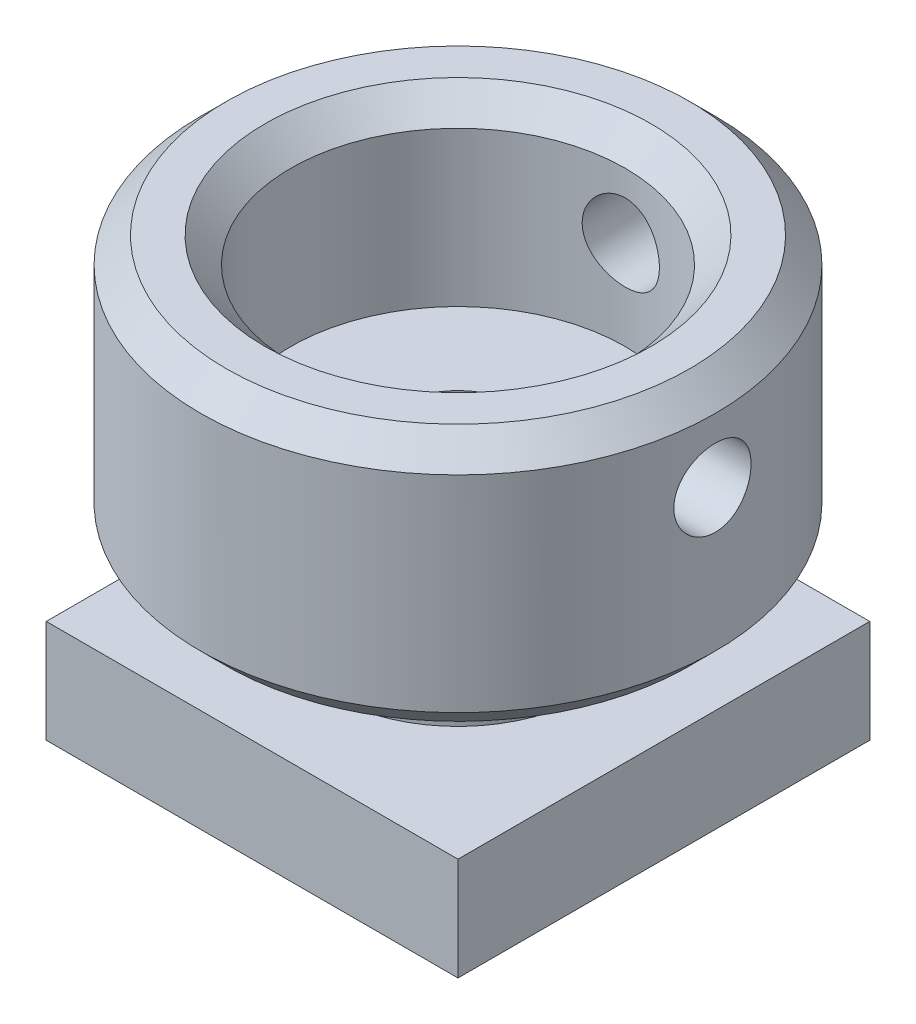
ISO-10303-21;
HEADER;
FILE_DESCRIPTION(('STEP AP214'),'2;1');
FILE_NAME('part.step','',(''),(''),'','','');
FILE_SCHEMA(('AUTOMOTIVE_DESIGN { 1 0 10303 214 1 1 1 1 }'));
ENDSEC;
DATA;
#1=APPLICATION_CONTEXT('core data for automotive mechanical design processes');
#2=APPLICATION_PROTOCOL_DEFINITION('international standard','automotive_design',2000,#1);
#3=PRODUCT_CONTEXT('',#1,'mechanical');
#4=PRODUCT('Part','Part','',(#3));
#5=PRODUCT_RELATED_PRODUCT_CATEGORY('part','',(#4));
#6=PRODUCT_DEFINITION_FORMATION('','',#4);
#7=PRODUCT_DEFINITION_CONTEXT('part definition',#1,'design');
#8=PRODUCT_DEFINITION('design','',#6,#7);
#9=PRODUCT_DEFINITION_SHAPE('','',#8);
#10=(LENGTH_UNIT() NAMED_UNIT(*) SI_UNIT(.MILLI.,.METRE.));
#11=(NAMED_UNIT(*) PLANE_ANGLE_UNIT() SI_UNIT($,.RADIAN.));
#12=(NAMED_UNIT(*) SI_UNIT($,.STERADIAN.) SOLID_ANGLE_UNIT());
#13=UNCERTAINTY_MEASURE_WITH_UNIT(LENGTH_MEASURE(1.E-05),#10,'distance_accuracy_value','');
#14=(GEOMETRIC_REPRESENTATION_CONTEXT(3) GLOBAL_UNCERTAINTY_ASSIGNED_CONTEXT((#13)) GLOBAL_UNIT_ASSIGNED_CONTEXT((#10,
#11,#12)) REPRESENTATION_CONTEXT('',''));
#15=CARTESIAN_POINT('',(0.,0.,0.));
#16=DIRECTION('',(0.,0.,1.));
#17=DIRECTION('',(1.,0.,0.));
#18=AXIS2_PLACEMENT_3D('',#15,#16,#17);
#19=CARTESIAN_POINT('',(8.,0.,0.));
#20=DIRECTION('',(0.,-1.,0.));
#21=DIRECTION('',(0.,0.,-1.));
#22=AXIS2_PLACEMENT_3D('',#19,#20,#21);
#23=PLANE('',#22);
#24=DIRECTION('',(-1.,0.,0.));
#25=VECTOR('',#24,1.);
#26=CARTESIAN_POINT('',(8.,0.,8.));
#27=LINE('',#26,#25);
#28=CARTESIAN_POINT('',(8.,0.,8.));
#29=VERTEX_POINT('',#28);
#30=CARTESIAN_POINT('',(-8.,0.,8.));
#31=VERTEX_POINT('',#30);
#32=EDGE_CURVE('E310',#29,#31,#27,.T.);
#33=ORIENTED_EDGE('',*,*,#32,.T.);
#34=DIRECTION('',(0.,0.,-1.));
#35=VECTOR('',#34,1.);
#36=CARTESIAN_POINT('',(-8.,0.,-8.));
#37=LINE('',#36,#35);
#38=CARTESIAN_POINT('',(-8.,0.,-8.));
#39=VERTEX_POINT('',#38);
#40=EDGE_CURVE('E309',#31,#39,#37,.T.);
#41=ORIENTED_EDGE('',*,*,#40,.T.);
#42=DIRECTION('',(1.,0.,0.));
#43=VECTOR('',#42,1.);
#44=CARTESIAN_POINT('',(8.,0.,-8.));
#45=LINE('',#44,#43);
#46=CARTESIAN_POINT('',(8.,0.,-8.));
#47=VERTEX_POINT('',#46);
#48=EDGE_CURVE('E112',#39,#47,#45,.T.);
#49=ORIENTED_EDGE('',*,*,#48,.T.);
#50=DIRECTION('',(0.,0.,1.));
#51=VECTOR('',#50,1.);
#52=CARTESIAN_POINT('',(8.,0.,-8.));
#53=LINE('',#52,#51);
#54=EDGE_CURVE('E95',#47,#29,#53,.T.);
#55=ORIENTED_EDGE('',*,*,#54,.T.);
#56=EDGE_LOOP('',(#33,#41,#49,#55));
#57=FACE_BOUND('',#56,.T.);
#58=CARTESIAN_POINT('',(0.,0.,0.));
#59=DIRECTION('',(0.,-1.,0.));
#60=DIRECTION('',(0.,0.,-1.));
#61=AXIS2_PLACEMENT_3D('',#58,#59,#60);
#62=CIRCLE('',#61,2.5);
#63=CARTESIAN_POINT('',(0.,0.,-2.5));
#64=VERTEX_POINT('',#63);
#65=EDGE_CURVE('E206',#64,#64,#62,.T.);
#66=ORIENTED_EDGE('',*,*,#65,.F.);
#67=EDGE_LOOP('',(#66));
#68=FACE_BOUND('',#67,.T.);
#69=ADVANCED_FACE('F35',(#57,#68),#23,.T.);
#70=CARTESIAN_POINT('',(0.,0.,0.));
#71=DIRECTION('',(0.,-1.,0.));
#72=DIRECTION('',(0.,0.,-1.));
#73=AXIS2_PLACEMENT_3D('',#70,#71,#72);
#74=CYLINDRICAL_SURFACE('',#73,2.5);
#75=ORIENTED_EDGE('',*,*,#65,.T.);
#76=EDGE_LOOP('',(#75));
#77=FACE_BOUND('',#76,.T.);
#78=CARTESIAN_POINT('',(0.,10.,0.));
#79=DIRECTION('',(0.,-1.,0.));
#80=DIRECTION('',(0.,0.,-1.));
#81=AXIS2_PLACEMENT_3D('',#78,#79,#80);
#82=CIRCLE('',#81,2.5);
#83=CARTESIAN_POINT('',(0.,10.,-2.5));
#84=VERTEX_POINT('',#83);
#85=EDGE_CURVE('E208',#84,#84,#82,.T.);
#86=ORIENTED_EDGE('',*,*,#85,.F.);
#87=EDGE_LOOP('',(#86));
#88=FACE_BOUND('',#87,.T.);
#89=ADVANCED_FACE('F165',(#77,#88),#74,.F.);
#90=CARTESIAN_POINT('',(2.5,10.,0.));
#91=DIRECTION('',(0.,1.,0.));
#92=DIRECTION('',(0.,0.,1.));
#93=AXIS2_PLACEMENT_3D('',#90,#91,#92);
#94=PLANE('',#93);
#95=ORIENTED_EDGE('',*,*,#85,.T.);
#96=EDGE_LOOP('',(#95));
#97=FACE_BOUND('',#96,.T.);
#98=CARTESIAN_POINT('',(0.,10.,0.));
#99=DIRECTION('',(0.,-1.,0.));
#100=DIRECTION('',(0.,0.,-1.));
#101=AXIS2_PLACEMENT_3D('',#98,#99,#100);
#102=CIRCLE('',#101,6.5);
#103=CARTESIAN_POINT('',(0.,10.,-6.5));
#104=VERTEX_POINT('',#103);
#105=EDGE_CURVE('E211',#104,#104,#102,.T.);
#106=ORIENTED_EDGE('',*,*,#105,.F.);
#107=EDGE_LOOP('',(#106));
#108=FACE_BOUND('',#107,.T.);
#109=ADVANCED_FACE('F160',(#97,#108),#94,.T.);
#110=CARTESIAN_POINT('',(0.,0.,0.));
#111=DIRECTION('',(0.,-1.,0.));
#112=DIRECTION('',(0.,0.,-1.));
#113=AXIS2_PLACEMENT_3D('',#110,#111,#112);
#114=CYLINDRICAL_SURFACE('',#113,6.5);
#115=CARTESIAN_POINT('',(0.,16.,0.));
#116=DIRECTION('',(0.,1.,0.));
#117=DIRECTION('',(0.,0.,1.));
#118=AXIS2_PLACEMENT_3D('',#115,#116,#117);
#119=CIRCLE('',#118,6.5);
#120=CARTESIAN_POINT('',(0.,16.,6.5));
#121=VERTEX_POINT('',#120);
#122=EDGE_CURVE('E12',#121,#121,#119,.T.);
#123=ORIENTED_EDGE('',*,*,#122,.T.);
#124=EDGE_LOOP('',(#123));
#125=FACE_BOUND('',#124,.T.);
#126=CARTESIAN_POINT('',(0.,15.,-6.5));
#127=CARTESIAN_POINT('',(-0.0830761724763336,14.9999973346441,-6.49999849532867));
#128=CARTESIAN_POINT('',(-0.166183602986825,14.9930750731889,-6.49839124214547));
#129=CARTESIAN_POINT('',(-0.330029933246624,14.9656023571143,-6.49213500375529));
#130=CARTESIAN_POINT('',(-0.410767233683359,14.9450429115586,-6.48748401185166));
#131=CARTESIAN_POINT('',(-0.567482400649434,14.8909803010591,-6.47565710646771));
#132=CARTESIAN_POINT('',(-0.643465410431951,14.8574914148686,-6.46848397910972));
#133=CARTESIAN_POINT('',(-0.788732955280494,14.7785677349316,-6.45238316831829));
#134=CARTESIAN_POINT('',(-0.858017512835932,14.7331329812941,-6.44345549077589));
#135=CARTESIAN_POINT('',(-0.989152353123201,14.6307547483228,-6.42464323305021));
#136=CARTESIAN_POINT('',(-1.0508667921612,14.5736396382975,-6.41474568654138));
#137=CARTESIAN_POINT('',(-1.16393060397694,14.4498900734287,-6.39519859507266));
#138=CARTESIAN_POINT('',(-1.21527896649909,14.3832546918395,-6.38554907436474));
#139=CARTESIAN_POINT('',(-1.30676695752559,14.2413330724397,-6.36746174180576));
#140=CARTESIAN_POINT('',(-1.34675925477786,14.1659495590232,-6.35904049089482));
#141=CARTESIAN_POINT('',(-1.4134539533006,14.0093049013494,-6.34455046029963));
#142=CARTESIAN_POINT('',(-1.44015813854147,13.9280445477549,-6.33848136485541));
#143=CARTESIAN_POINT('',(-1.47906424258559,13.7634341984173,-6.32951534623235));
#144=CARTESIAN_POINT('',(-1.49150809496878,13.6801443266252,-6.32656557105072));
#145=CARTESIAN_POINT('',(-1.50229307046532,13.5126109129544,-6.32401364937952));
#146=CARTESIAN_POINT('',(-1.50063613156307,13.4283675037173,-6.32441104286173));
#147=CARTESIAN_POINT('',(-1.48346063285702,13.2631371921762,-6.32846083321139));
#148=CARTESIAN_POINT('',(-1.46822575315177,13.1821189186561,-6.33204661249556));
#149=CARTESIAN_POINT('',(-1.42477741479347,13.0238202080984,-6.34196351386388));
#150=CARTESIAN_POINT('',(-1.3965631546267,12.9465400022229,-6.34829480548987));
#151=CARTESIAN_POINT('',(-1.32770349075045,12.7971273283591,-6.36305332227188));
#152=CARTESIAN_POINT('',(-1.28695129246526,12.725045919089,-6.37149843240945));
#153=CARTESIAN_POINT('',(-1.19424748975254,12.5886407637106,-6.38952239681953));
#154=CARTESIAN_POINT('',(-1.14229419645529,12.524318189741,-6.39910142196225));
#155=CARTESIAN_POINT('',(-1.02717321086452,12.403626049949,-6.41859777640793));
#156=CARTESIAN_POINT('',(-0.963764950845044,12.347486114875,-6.42851768847713));
#157=CARTESIAN_POINT('',(-0.828318641053397,12.2465969290247,-6.44736816069401));
#158=CARTESIAN_POINT('',(-0.756280398745022,12.2018479324514,-6.45629869876005));
#159=CARTESIAN_POINT('',(-0.605321277972365,12.1249440858567,-6.47219854082993));
#160=CARTESIAN_POINT('',(-0.526383143294243,12.0928219843073,-6.47916273202417));
#161=CARTESIAN_POINT('',(-0.364032396252578,12.042363856305,-6.49030757986402));
#162=CARTESIAN_POINT('',(-0.280620512374233,12.0240255926115,-6.49448868821629));
#163=CARTESIAN_POINT('',(-0.113657323931637,12.0019958496519,-6.49953102945198));
#164=CARTESIAN_POINT('',(-0.0301494450127266,11.9979910639403,-6.50046326526885));
#165=CARTESIAN_POINT('',(0.136342371579225,12.0038890147593,-6.49910299913129));
#166=CARTESIAN_POINT('',(0.219326348562746,12.013790695068,-6.49681074208306));
#167=CARTESIAN_POINT('',(0.381357903798023,12.0469611966058,-6.48930412349636));
#168=CARTESIAN_POINT('',(0.460441464875699,12.0700632413172,-6.48412623941868));
#169=CARTESIAN_POINT('',(0.613609622481662,12.1287915889244,-6.47142910428788));
#170=CARTESIAN_POINT('',(0.687693760726584,12.1644190381359,-6.4639096389422));
#171=CARTESIAN_POINT('',(0.830037615110183,12.247822643921,-6.44718996088191));
#172=CARTESIAN_POINT('',(0.898188410296321,12.2957796918852,-6.43796535296184));
#173=CARTESIAN_POINT('',(1.02558718048178,12.4022456173586,-6.41890391913982));
#174=CARTESIAN_POINT('',(1.08483385664762,12.4607560315416,-6.40906700421673));
#175=CARTESIAN_POINT('',(1.19400102833016,12.588112385879,-6.38964047483402));
#176=CARTESIAN_POINT('',(1.24370343589041,12.6571469646774,-6.3800601750374));
#177=CARTESIAN_POINT('',(1.33081235446408,12.8027658802153,-6.36246188496285));
#178=CARTESIAN_POINT('',(1.36821941224619,12.8793498810385,-6.35444382521927));
#179=CARTESIAN_POINT('',(1.42941066868128,13.0374759884225,-6.34095951164846));
#180=CARTESIAN_POINT('',(1.45327404481081,13.1189861296834,-6.33547846174879));
#181=CARTESIAN_POINT('',(1.48692530676325,13.2850039928478,-6.3276660054956));
#182=CARTESIAN_POINT('',(1.49671574099562,13.36951116919,-6.32533402889437));
#183=CARTESIAN_POINT('',(1.50182536015785,13.5369182270526,-6.32412253425542));
#184=CARTESIAN_POINT('',(1.4974912787147,13.6198071106486,-6.32516029248236));
#185=CARTESIAN_POINT('',(1.4752568598088,13.7836386786682,-6.33038270361015));
#186=CARTESIAN_POINT('',(1.45735672124417,13.8645813916076,-6.33456731037362));
#187=CARTESIAN_POINT('',(1.40867420720142,14.0219099107911,-6.34556939165105));
#188=CARTESIAN_POINT('',(1.37794771033571,14.0983138607059,-6.35237543592818));
#189=CARTESIAN_POINT('',(1.30453082227099,14.2449318065413,-6.36785683112449));
#190=CARTESIAN_POINT('',(1.26183902581513,14.3151450741273,-6.37653240158128));
#191=CARTESIAN_POINT('',(1.16457679516262,14.4490855285901,-6.39501829374307));
#192=CARTESIAN_POINT('',(1.10976162033286,14.5126321195496,-6.4048496868242));
#193=CARTESIAN_POINT('',(0.990297714593203,14.6297382476383,-6.42440402438128));
#194=CARTESIAN_POINT('',(0.925646696024372,14.6832954549303,-6.43412694306169));
#195=CARTESIAN_POINT('',(0.787191932761547,14.7796672679488,-6.45253999299533));
#196=CARTESIAN_POINT('',(0.71326686908488,14.8223111182898,-6.46121270567525));
#197=CARTESIAN_POINT('',(0.559109641475362,14.8944991494086,-6.47637045552876));
#198=CARTESIAN_POINT('',(0.478882547101929,14.9240537351029,-6.48285722936411));
#199=CARTESIAN_POINT('',(0.332210374198764,14.9642784735557,-6.49182723396727));
#200=CARTESIAN_POINT('',(0.266526367321005,14.977647271027,-6.49487228966801));
#201=CARTESIAN_POINT('',(0.133901630280834,14.9955088666147,-6.4989592245111));
#202=CARTESIAN_POINT('',(0.0669609687898299,15.0000021483273,-6.5000012127936));
#203=CARTESIAN_POINT('',(0.,15.,-6.5));
#204=B_SPLINE_CURVE_WITH_KNOTS('',3,(#126,#127,#128,#129,#130,#131,#132,#133,#134,#135,#136,
#137,#138,#139,#140,#141,#142,#143,#144,#145,#146,#147,#148,#149,#150,#151,#152,#153,#154,#155,
#156,#157,#158,#159,#160,#161,#162,#163,#164,#165,#166,#167,#168,#169,#170,#171,#172,#173,#174,
#175,#176,#177,#178,#179,#180,#181,#182,#183,#184,#185,#186,#187,#188,#189,#190,#191,#192,#193,
#194,#195,#196,#197,#198,#199,#200,#201,#202,#203),.UNSPECIFIED.,.T.,.F.,(4,2,2,2,2,2,2,2,2,2,2,
2,2,2,2,2,2,2,2,2,2,2,2,2,2,2,2,2,2,2,2,2,2,2,2,2,2,2,4),(0.,0.248983311217112,
0.498130939431094,0.74700420247274,0.995876629917193,1.24870930222221,1.50156660317463,
1.75756840109409,2.01353582069619,2.26509316141454,2.516615929156,2.76300377758326,
3.00940684320481,3.25796969712263,3.50657005489339,3.76117526279508,4.01578615203539,
4.27105309772999,4.52627860236002,4.77589001432912,5.02548246887367,5.27198911757473,
5.51851833225477,5.76889433751047,6.01930682944862,6.27489540554872,6.53047261420156,
6.78453988631535,7.03856114466411,7.2863940143866,7.53422325058911,7.78098389306525,
8.02777352833795,8.280093237097,8.53247172132996,8.7885860972729,9.04449651578214,
9.24519271684368,9.44587798236127),.UNSPECIFIED.);
#205=CARTESIAN_POINT('',(0.,15.,-6.5));
#206=VERTEX_POINT('',#205);
#207=EDGE_CURVE('E104',#206,#206,#204,.T.);
#208=ORIENTED_EDGE('',*,*,#207,.F.);
#209=EDGE_LOOP('',(#208));
#210=FACE_BOUND('',#209,.T.);
#211=CARTESIAN_POINT('',(6.32455532033676,13.5,-1.49999999999999));
#212=CARTESIAN_POINT('',(6.3245569864533,13.4169570351854,-1.49999731225033));
#213=CARTESIAN_POINT('',(6.32620871498675,13.3338827597812,-1.49308039515327));
#214=CARTESIAN_POINT('',(6.33262329615483,13.1701052379156,-1.4656308283467));
#215=CARTESIAN_POINT('',(6.33738823434819,13.0894036188105,-1.4450890511176));
#216=CARTESIAN_POINT('',(6.34946149326292,12.9327640807197,-1.39107808122441));
#217=CARTESIAN_POINT('',(6.35676684114118,12.8568207155793,-1.35762399382079));
#218=CARTESIAN_POINT('',(6.37309417235741,12.7116201965556,-1.2787823819057));
#219=CARTESIAN_POINT('',(6.3821161610391,12.642363063487,-1.23339482024642));
#220=CARTESIAN_POINT('',(6.40104967504166,12.5111997728031,-1.13106531351182));
#221=CARTESIAN_POINT('',(6.41097365327686,12.4494375694388,-1.07394112222389));
#222=CARTESIAN_POINT('',(6.43048432059803,12.3362808554485,-0.950153022384879));
#223=CARTESIAN_POINT('',(6.44007098152559,12.2848872086767,-0.883488319758351));
#224=CARTESIAN_POINT('',(6.45796329743801,12.1933497795479,-0.741538525798731));
#225=CARTESIAN_POINT('',(6.46625254288521,12.1533455611307,-0.666161188886935));
#226=CARTESIAN_POINT('',(6.4804748675058,12.0866271499198,-0.509529827009767));
#227=CARTESIAN_POINT('',(6.48640824159883,12.0599112935173,-0.428276539131434));
#228=CARTESIAN_POINT('',(6.49516228038752,12.0209838361084,-0.263698138287234));
#229=CARTESIAN_POINT('',(6.49803523989436,12.0085282762478,-0.180433557461704));
#230=CARTESIAN_POINT('',(6.50052632032964,11.9977111063356,-0.0129504286120401));
#231=CARTESIAN_POINT('',(6.50014485393698,11.9993477093213,0.0712679971068401));
#232=CARTESIAN_POINT('',(6.49620964643357,12.0164890163381,0.236582621768766));
#233=CARTESIAN_POINT('',(6.49271608840583,12.0317306316163,0.317707745320443));
#234=CARTESIAN_POINT('',(6.48301834797385,12.0752287253271,0.476216582142185));
#235=CARTESIAN_POINT('',(6.47681403431541,12.1034858339707,0.55360011404364));
#236=CARTESIAN_POINT('',(6.46229685303168,12.1724380751291,0.70314564125389));
#237=CARTESIAN_POINT('',(6.45396755520295,12.2132306579001,0.775261043983779));
#238=CARTESIAN_POINT('',(6.43611015762813,12.3060227931843,0.911717486022488));
#239=CARTESIAN_POINT('',(6.42658187760235,12.358024031878,0.976057353339058));
#240=CARTESIAN_POINT('',(6.40711077081721,12.4731817531537,1.09670294212734));
#241=CARTESIAN_POINT('',(6.39716345312091,12.5365684122294,1.15278844211966));
#242=CARTESIAN_POINT('',(6.37818005958509,12.671951232213,1.2535777261211));
#243=CARTESIAN_POINT('',(6.36914401445328,12.7439476830717,1.29828112665808));
#244=CARTESIAN_POINT('',(6.35299268291512,12.8948902570441,1.37515073667099));
#245=CARTESIAN_POINT('',(6.34588444121947,12.9738605075876,1.40727114955078));
#246=CARTESIAN_POINT('',(6.33448805998483,13.136281777224,1.45771632822006));
#247=CARTESIAN_POINT('',(6.3301994165034,13.2197319927341,1.47604355932843));
#248=CARTESIAN_POINT('',(6.3250317404996,13.3867209200017,1.49803182193798));
#249=CARTESIAN_POINT('',(6.32407774971017,13.4702148987643,1.50201534258489));
#250=CARTESIAN_POINT('',(6.32548450645529,13.636674037239,1.49607984528293));
#251=CARTESIAN_POINT('',(6.32784499818498,13.7196392372648,1.48616190022034));
#252=CARTESIAN_POINT('',(6.33554357373051,13.8815355452195,1.45298594915778));
#253=CARTESIAN_POINT('',(6.34084115536032,13.9605059188058,1.4299092799682));
#254=CARTESIAN_POINT('',(6.35377976011193,14.1134587829266,1.37126901136112));
#255=CARTESIAN_POINT('',(6.36142102796638,14.1874407515767,1.33570410783974));
#256=CARTESIAN_POINT('',(6.3783481643039,14.3297015368796,1.25239967909703));
#257=CARTESIAN_POINT('',(6.38765975817363,14.3978621645113,1.2044636575387));
#258=CARTESIAN_POINT('',(6.40681231547822,14.525290362933,1.09803158820711));
#259=CARTESIAN_POINT('',(6.41665335234629,14.5845566957509,1.03953407290058));
#260=CARTESIAN_POINT('',(6.43600563629776,14.6937858146995,0.912172454289634));
#261=CARTESIAN_POINT('',(6.44550564512701,14.7435275221274,0.843116740081695));
#262=CARTESIAN_POINT('',(6.46288988462929,14.8307054024991,0.697443174334184));
#263=CARTESIAN_POINT('',(6.47077419484896,14.8681421813135,0.620825695362698));
#264=CARTESIAN_POINT('',(6.48399176445978,14.9293497379185,0.462705252392957));
#265=CARTESIAN_POINT('',(6.48934209685309,14.95321220028,0.381239271946503));
#266=CARTESIAN_POINT('',(6.49696306189839,14.9868765184722,0.215316112505555));
#267=CARTESIAN_POINT('',(6.4992341959149,14.9966806633362,0.130859422765979));
#268=CARTESIAN_POINT('',(6.5004239080538,15.0018374522829,-0.0365573790394653));
#269=CARTESIAN_POINT('',(6.49941871891103,14.997518697002,-0.119506994675809));
#270=CARTESIAN_POINT('',(6.49433417348681,14.9752938144933,-0.283464184827991));
#271=CARTESIAN_POINT('',(6.49025488508533,14.957387987285,-0.364471802184833));
#272=CARTESIAN_POINT('',(6.47948846592308,14.9086620184161,-0.521957811169677));
#273=CARTESIAN_POINT('',(6.47281172349154,14.8778932848991,-0.598452864232125));
#274=CARTESIAN_POINT('',(6.45755951980291,14.8043633185434,-0.745235906918299));
#275=CARTESIAN_POINT('',(6.448983852572,14.7616007846191,-0.815523222039257));
#276=CARTESIAN_POINT('',(6.43064181454253,14.6642512439519,-0.949482403657669));
#277=CARTESIAN_POINT('',(6.42085432839479,14.6094360792657,-1.01298558523277));
#278=CARTESIAN_POINT('',(6.40129818016079,14.4899912114526,-1.13000416077697));
#279=CARTESIAN_POINT('',(6.3915295232739,14.4253591070599,-1.18351710393229));
#280=CARTESIAN_POINT('',(6.37294956195203,14.2869280193547,-1.27982908304766));
#281=CARTESIAN_POINT('',(6.36415514239876,14.2130041951525,-1.32245215470277));
#282=CARTESIAN_POINT('',(6.34873668426056,14.0588521583482,-1.39460165995165));
#283=CARTESIAN_POINT('',(6.34211090335335,13.9786290712588,-1.42413861394221));
#284=CARTESIAN_POINT('',(6.33293595806901,13.8320008810661,-1.4643238284563));
#285=CARTESIAN_POINT('',(6.32981507708549,13.766359139735,-1.47767548439028));
#286=CARTESIAN_POINT('',(6.32562414905363,13.6338183254375,-1.49551438449415));
#287=CARTESIAN_POINT('',(6.32455397771369,13.5669193289202,-1.50000216589573));
#288=CARTESIAN_POINT('',(6.32455532033676,13.5,-1.49999999999999));
#289=B_SPLINE_CURVE_WITH_KNOTS('',3,(#211,#212,#213,#214,#215,#216,#217,#218,#219,#220,#221,
#222,#223,#224,#225,#226,#227,#228,#229,#230,#231,#232,#233,#234,#235,#236,#237,#238,#239,#240,
#241,#242,#243,#244,#245,#246,#247,#248,#249,#250,#251,#252,#253,#254,#255,#256,#257,#258,#259,
#260,#261,#262,#263,#264,#265,#266,#267,#268,#269,#270,#271,#272,#273,#274,#275,#276,#277,#278,
#279,#280,#281,#282,#283,#284,#285,#286,#287,#288),.UNSPECIFIED.,.T.,.F.,(4,2,2,2,2,2,2,2,2,2,2,
2,2,2,2,2,2,2,2,2,2,2,2,2,2,2,2,2,2,2,2,2,2,2,2,2,2,2,4),(0.,0.248883465803495,
0.497933831393373,0.746693728125548,0.995454399233477,1.24841764299143,1.50140195363392,
1.75736456623773,2.0132951260639,2.26477865330972,2.51623029155068,2.76292232697427,
3.00962630849784,3.25829886944373,3.50700886572534,3.76147084783256,4.01594140183619,
4.27132969927226,4.52667233913444,4.77623696750943,5.02578233606484,5.27196914049439,
5.51818166102453,5.76857543923026,6.01900403679117,6.27468245443429,6.53034828108668,
6.78426611877409,7.03814260781417,7.28615450356153,7.5341609230558,7.78118549040826,
8.02823686531897,8.28044436759844,8.53271366056533,8.78883275968394,9.04474558022909,
9.24531794770387,9.44587815829005),.UNSPECIFIED.);
#290=CARTESIAN_POINT('',(6.32455532033676,13.5,-1.49999999999999));
#291=VERTEX_POINT('',#290);
#292=EDGE_CURVE('E111',#291,#291,#289,.T.);
#293=ORIENTED_EDGE('',*,*,#292,.F.);
#294=EDGE_LOOP('',(#293));
#295=FACE_BOUND('',#294,.T.);
#296=ORIENTED_EDGE('',*,*,#105,.T.);
#297=EDGE_LOOP('',(#296));
#298=FACE_BOUND('',#297,.T.);
#299=ADVANCED_FACE('F117',(#125,#210,#295,#298),#114,.F.);
#300=CARTESIAN_POINT('',(6.5,17.,0.));
#301=DIRECTION('',(0.,1.,0.));
#302=DIRECTION('',(0.,0.,1.));
#303=AXIS2_PLACEMENT_3D('',#300,#301,#302);
#304=PLANE('',#303);
#305=CARTESIAN_POINT('',(0.,17.,0.));
#306=DIRECTION('',(0.,1.,0.));
#307=DIRECTION('',(0.,0.,1.));
#308=AXIS2_PLACEMENT_3D('',#305,#306,#307);
#309=CIRCLE('',#308,7.5);
#310=CARTESIAN_POINT('',(0.,17.,7.5));
#311=VERTEX_POINT('',#310);
#312=EDGE_CURVE('E43',#311,#311,#309,.F.);
#313=ORIENTED_EDGE('',*,*,#312,.T.);
#314=EDGE_LOOP('',(#313));
#315=FACE_BOUND('',#314,.T.);
#316=CARTESIAN_POINT('',(0.,17.,0.));
#317=DIRECTION('',(0.,1.,0.));
#318=DIRECTION('',(0.,0.,1.));
#319=AXIS2_PLACEMENT_3D('',#316,#317,#318);
#320=CIRCLE('',#319,9.);
#321=CARTESIAN_POINT('',(0.,17.,9.));
#322=VERTEX_POINT('',#321);
#323=EDGE_CURVE('E192',#322,#322,#320,.T.);
#324=ORIENTED_EDGE('',*,*,#323,.T.);
#325=EDGE_LOOP('',(#324));
#326=FACE_BOUND('',#325,.T.);
#327=ADVANCED_FACE('F151',(#315,#326),#304,.T.);
#328=CARTESIAN_POINT('',(0.,0.,0.));
#329=DIRECTION('',(0.,-1.,0.));
#330=DIRECTION('',(0.,0.,-1.));
#331=AXIS2_PLACEMENT_3D('',#328,#329,#330);
#332=CYLINDRICAL_SURFACE('',#331,10.);
#333=CARTESIAN_POINT('',(0.,16.,0.));
#334=DIRECTION('',(0.,1.,0.));
#335=DIRECTION('',(0.,0.,1.));
#336=AXIS2_PLACEMENT_3D('',#333,#334,#335);
#337=CIRCLE('',#336,10.);
#338=CARTESIAN_POINT('',(0.,16.,10.));
#339=VERTEX_POINT('',#338);
#340=EDGE_CURVE('E195',#339,#339,#337,.F.);
#341=ORIENTED_EDGE('',*,*,#340,.T.);
#342=EDGE_LOOP('',(#341));
#343=FACE_BOUND('',#342,.T.);
#344=CARTESIAN_POINT('',(0.,8.,0.));
#345=DIRECTION('',(0.,-1.,0.));
#346=DIRECTION('',(0.,0.,-1.));
#347=AXIS2_PLACEMENT_3D('',#344,#345,#346);
#348=CIRCLE('',#347,10.);
#349=CARTESIAN_POINT('',(0.,8.,-10.));
#350=VERTEX_POINT('',#349);
#351=EDGE_CURVE('E140',#350,#350,#348,.F.);
#352=ORIENTED_EDGE('',*,*,#351,.T.);
#353=EDGE_LOOP('',(#352));
#354=FACE_BOUND('',#353,.T.);
#355=CARTESIAN_POINT('',(0.,15.,-10.));
#356=CARTESIAN_POINT('',(0.0837515444816415,14.9999965461847,-9.99999865771297));
#357=CARTESIAN_POINT('',(0.167551685082131,14.9929619991594,-9.9989368253704));
#358=CARTESIAN_POINT('',(0.33280962799491,14.9650168000172,-9.99480315973187));
#359=CARTESIAN_POINT('',(0.414265068974226,14.9440926370551,-9.99172936938473));
#360=CARTESIAN_POINT('',(0.572418086221855,14.8890074950324,-9.98391721219526));
#361=CARTESIAN_POINT('',(0.649119207826794,14.854856520494,-9.9791801037092));
#362=CARTESIAN_POINT('',(0.795690428635248,14.7743116205831,-9.96856475911724));
#363=CARTESIAN_POINT('',(0.865561474725182,14.7279193955826,-9.96268668152773));
#364=CARTESIAN_POINT('',(0.997046719562119,14.6238227350601,-9.95039170991452));
#365=CARTESIAN_POINT('',(1.05859983222549,14.5660415437918,-9.94397133890331));
#366=CARTESIAN_POINT('',(1.17117490668948,14.4409723111061,-9.93134261133239));
#367=CARTESIAN_POINT('',(1.22219626272935,14.3736837232215,-9.92513426698505));
#368=CARTESIAN_POINT('',(1.31249729499942,14.2310993564775,-9.91359877458726));
#369=CARTESIAN_POINT('',(1.35171787037204,14.1557657530187,-9.90827611975031));
#370=CARTESIAN_POINT('',(1.41692632171055,13.9994871793546,-9.89916211306268));
#371=CARTESIAN_POINT('',(1.44291491889162,13.9185425152561,-9.89537067775449));
#372=CARTESIAN_POINT('',(1.4807319879891,13.7539819581283,-9.88978256218674));
#373=CARTESIAN_POINT('',(1.49266503640517,13.670390606592,-9.8879711574125));
#374=CARTESIAN_POINT('',(1.50235624033931,13.5023738340127,-9.88650348970582));
#375=CARTESIAN_POINT('',(1.50011520973795,13.4179484611375,-9.88684710303147));
#376=CARTESIAN_POINT('',(1.48160733250786,13.2513989198059,-9.8896371835241));
#377=CARTESIAN_POINT('',(1.46545695927749,13.1692614735152,-9.8920661876155));
#378=CARTESIAN_POINT('',(1.41977117403733,13.0088756311285,-9.89872608126367));
#379=CARTESIAN_POINT('',(1.39023538337811,12.9306273451193,-9.9029570217938));
#380=CARTESIAN_POINT('',(1.31849603529735,12.7798866287171,-9.91276335545481));
#381=CARTESIAN_POINT('',(1.27624314283197,12.7074180309076,-9.91834396766527));
#382=CARTESIAN_POINT('',(1.18030413128954,12.5705554042181,-9.93021707574548));
#383=CARTESIAN_POINT('',(1.12661726182477,12.5061619057306,-9.93650961832501));
#384=CARTESIAN_POINT('',(1.00869493078247,12.3866023392603,-9.9491747305621));
#385=CARTESIAN_POINT('',(0.944359329641995,12.3315350097137,-9.95554747112815));
#386=CARTESIAN_POINT('',(0.807307089894181,12.2329640654928,-9.96759647648462));
#387=CARTESIAN_POINT('',(0.734590414588165,12.1894605014561,-9.9732727382251));
#388=CARTESIAN_POINT('',(0.582754598213682,12.1152469135005,-9.98329515585393));
#389=CARTESIAN_POINT('',(0.503631677836777,12.0845445081597,-9.98764051925428));
#390=CARTESIAN_POINT('',(0.341273182487059,12.0368906103146,-9.99450490557069));
#391=CARTESIAN_POINT('',(0.258037885952599,12.0199381881844,-9.99702405195467));
#392=CARTESIAN_POINT('',(0.0906695676436462,12.0003967701833,-9.99993581133871));
#393=CARTESIAN_POINT('',(0.00655273187047105,11.9976720286207,-10.0003485209039));
#394=CARTESIAN_POINT('',(-0.160936677662281,12.006303005311,-9.99905561015226));
#395=CARTESIAN_POINT('',(-0.244309274381874,12.0176582876681,-9.99735005541369));
#396=CARTESIAN_POINT('',(-0.407532387431404,12.0540141001776,-9.99202468615333));
#397=CARTESIAN_POINT('',(-0.487397963079833,12.0789484960309,-9.98841415207984));
#398=CARTESIAN_POINT('',(-0.641814958642993,12.1416849974618,-9.97968235658369));
#399=CARTESIAN_POINT('',(-0.716366128795093,12.1794877073336,-9.97456102421565));
#400=CARTESIAN_POINT('',(-0.858634979291913,12.2672062245639,-9.96332682468686));
#401=CARTESIAN_POINT('',(-0.926299009891558,12.3172081400128,-9.95720701626746));
#402=CARTESIAN_POINT('',(-1.0523236731777,12.4277858116288,-9.94467863012165));
#403=CARTESIAN_POINT('',(-1.11068376479339,12.4883621823247,-9.93827003562868));
#404=CARTESIAN_POINT('',(-1.21693784957194,12.6189735331765,-9.92582264304494));
#405=CARTESIAN_POINT('',(-1.2647408474742,12.6890829251948,-9.91978736017588));
#406=CARTESIAN_POINT('',(-1.34789129270583,12.8364160405118,-9.90883219104904));
#407=CARTESIAN_POINT('',(-1.38323907656435,12.9136395715215,-9.90391227465629));
#408=CARTESIAN_POINT('',(-1.44033467323942,13.0727375336231,-9.89577033008645));
#409=CARTESIAN_POINT('',(-1.46213037141634,13.1545944609712,-9.89254233006439));
#410=CARTESIAN_POINT('',(-1.49165549501585,13.3208590154351,-9.88813382297803));
#411=CARTESIAN_POINT('',(-1.49938589183065,13.4052664659947,-9.88695317451771));
#412=CARTESIAN_POINT('',(-1.50053786669438,13.5733290633158,-9.88677832610842));
#413=CARTESIAN_POINT('',(-1.49410252167311,13.6569832417569,-9.88776226333502));
#414=CARTESIAN_POINT('',(-1.46741229544377,13.8220052633235,-9.89175820611174));
#415=CARTESIAN_POINT('',(-1.44715743638626,13.9033731101134,-9.89477020841118));
#416=CARTESIAN_POINT('',(-1.39345373518664,14.0614730822343,-9.90247526112297));
#417=CARTESIAN_POINT('',(-1.36001489324313,14.1382086704334,-9.90716703716076));
#418=CARTESIAN_POINT('',(-1.28090667642308,14.2850036338024,-9.91770454557702));
#419=CARTESIAN_POINT('',(-1.23523688741501,14.3550627828036,-9.92355031702724));
#420=CARTESIAN_POINT('',(-1.13244337659163,14.4872430579752,-9.93580743364938));
#421=CARTESIAN_POINT('',(-1.07521369039805,14.5492813332471,-9.94222367881967));
#422=CARTESIAN_POINT('',(-0.951148841082826,14.6629245547878,-9.95485788826637));
#423=CARTESIAN_POINT('',(-0.884311448350933,14.7145270725762,-9.96107580610759));
#424=CARTESIAN_POINT('',(-0.742495707543714,14.8060876766074,-9.97265185790521));
#425=CARTESIAN_POINT('',(-0.667474576764753,14.8459801092147,-9.9780050712882));
#426=CARTESIAN_POINT('',(-0.511751870248713,14.912538516758,-9.98720028802959));
#427=CARTESIAN_POINT('',(-0.431056277096699,14.9392181900537,-9.99104385565757));
#428=CARTESIAN_POINT('',(-0.291665727889326,14.9725413427101,-9.99590939261506));
#429=CARTESIAN_POINT('',(-0.233831133495276,14.9828226015388,-9.99743549179557));
#430=CARTESIAN_POINT('',(-0.117338971600124,14.9965530977126,-9.99948125947896));
#431=CARTESIAN_POINT('',(-0.0586814143344166,15.0000024199525,-10.0000009404877));
#432=CARTESIAN_POINT('',(0.,15.,-10.));
#433=B_SPLINE_CURVE_WITH_KNOTS('',3,(#355,#356,#357,#358,#359,#360,#361,#362,#363,#364,#365,
#366,#367,#368,#369,#370,#371,#372,#373,#374,#375,#376,#377,#378,#379,#380,#381,#382,#383,#384,
#385,#386,#387,#388,#389,#390,#391,#392,#393,#394,#395,#396,#397,#398,#399,#400,#401,#402,#403,
#404,#405,#406,#407,#408,#409,#410,#411,#412,#413,#414,#415,#416,#417,#418,#419,#420,#421,#422,
#423,#424,#425,#426,#427,#428,#429,#430,#431,#432),.UNSPECIFIED.,.T.,.F.,(4,2,2,2,2,2,2,2,2,2,2,
2,2,2,2,2,2,2,2,2,2,2,2,2,2,2,2,2,2,2,2,2,2,2,2,2,2,2,4),(0.,0.251040205031661,
0.502324962929147,0.753420023583231,1.00448022419759,1.25729416136842,1.51012263572579,
1.76419702395374,2.01825756225505,2.27041564605923,2.5225592509898,2.77261177195744,
3.02267136690359,3.27371383476156,3.52477278308531,3.77834291255406,4.03191415238665,
4.28563608984871,4.53934087193398,4.79062058544251,5.04189251991151,5.29195148965944,
5.54202220376269,5.79391188036903,6.04581620028625,6.29981366584667,6.55380426808827,
6.80689223457163,7.05996272137171,7.31048888261058,7.56101464229558,7.81135073984141,
8.06169531466873,8.31444829965714,8.56726003468726,8.82146323384726,9.07540233261434,
9.25129851978801,9.42719252123283),.UNSPECIFIED.);
#434=CARTESIAN_POINT('',(0.,15.,-10.));
#435=VERTEX_POINT('',#434);
#436=EDGE_CURVE('E133',#435,#435,#433,.T.);
#437=ORIENTED_EDGE('',*,*,#436,.F.);
#438=EDGE_LOOP('',(#437));
#439=FACE_BOUND('',#438,.T.);
#440=CARTESIAN_POINT('',(9.8868599666426,13.5,-1.49999999999999));
#441=CARTESIAN_POINT('',(9.88686136668593,13.58374556929,-1.49999654107283));
#442=CARTESIAN_POINT('',(9.88793551739101,13.6675397507507,-1.4929629638849));
#443=CARTESIAN_POINT('',(9.8921131480324,13.8327853148831,-1.46502196657));
#444=CARTESIAN_POINT('',(9.8952186073143,13.91423433148,-1.44410101402627));
#445=CARTESIAN_POINT('',(9.90309938986228,14.0723737554469,-1.38902526098083));
#446=CARTESIAN_POINT('',(9.90787343131536,14.1490677625422,-1.35488061681396));
#447=CARTESIAN_POINT('',(9.91855194113146,14.2956270307721,-1.2743506308779));
#448=CARTESIAN_POINT('',(9.92445625383669,14.3654932302143,-1.22796697429871));
#449=CARTESIAN_POINT('',(9.9367828924804,14.4969838167543,-1.12387902418557));
#450=CARTESIAN_POINT('',(9.94320862458058,14.5585456134067,-1.06609605584819));
#451=CARTESIAN_POINT('',(9.95582368169048,14.6711374856555,-0.941019605444366));
#452=CARTESIAN_POINT('',(9.96201299368615,14.722166982167,-0.873725600786522));
#453=CARTESIAN_POINT('',(9.97349347428186,14.8124766316914,-0.731136358052739));
#454=CARTESIAN_POINT('',(9.97878018435569,14.8516991503225,-0.655804227365761));
#455=CARTESIAN_POINT('',(9.98782206746405,14.9169115988082,-0.49952885010697));
#456=CARTESIAN_POINT('',(9.99157732141945,14.9429022278429,-0.418585900270674));
#457=CARTESIAN_POINT('',(9.99710914797782,14.9807233885308,-0.254031123090567));
#458=CARTESIAN_POINT('',(9.99890035887344,14.9926587263872,-0.170443884389865));
#459=CARTESIAN_POINT('',(10.0003524476958,15.0023559348249,-0.00243520401947815));
#460=CARTESIAN_POINT('',(10.0000134440494,15.0001185933197,0.0819861910157467));
#461=CARTESIAN_POINT('',(9.99725499660796,14.9816166622376,0.248551718200519));
#462=CARTESIAN_POINT('',(9.99485227652479,14.9654648282085,0.330708691400007));
#463=CARTESIAN_POINT('',(9.98825500227851,14.9197693936774,0.491132829143135));
#464=CARTESIAN_POINT('',(9.98406040199739,14.8902254484986,0.569399893513479));
#465=CARTESIAN_POINT('',(9.97432193873206,14.8184690030829,0.720163780770312));
#466=CARTESIAN_POINT('',(9.96877303515638,14.7762090348913,0.792637672323591));
#467=CARTESIAN_POINT('',(9.95694438245422,14.68025480633,0.929507907150171));
#468=CARTESIAN_POINT('',(9.95066458523184,14.6265597932931,0.993903718271729));
#469=CARTESIAN_POINT('',(9.93800158192627,14.5086315511734,1.11345448272264));
#470=CARTESIAN_POINT('',(9.93161796623257,14.4442998780299,1.16851232950946));
#471=CARTESIAN_POINT('',(9.91952704453523,14.3072589228763,1.26706599338812));
#472=CARTESIAN_POINT('',(9.91381974269649,14.2345495892801,1.31056173927998));
#473=CARTESIAN_POINT('',(9.90372775286856,14.0827160370594,1.38476964534604));
#474=CARTESIAN_POINT('',(9.89934409845291,14.0035868663376,1.4154718227008));
#475=CARTESIAN_POINT('',(9.89241402899059,13.8412147448526,1.46312336208878));
#476=CARTESIAN_POINT('',(9.88986748446299,13.7579720844532,1.48007369337325));
#477=CARTESIAN_POINT('',(9.88692451395027,13.5905999104225,1.49960720086654));
#478=CARTESIAN_POINT('',(9.88650748802574,13.5064868117985,1.50232803265051));
#479=CARTESIAN_POINT('',(9.88781607937153,13.3390058051827,1.49369057019818));
#480=CARTESIAN_POINT('',(9.88954163015778,13.2556378741492,1.48233271282301));
#481=CARTESIAN_POINT('',(9.89492202461453,13.0924401820344,1.44597702952765));
#482=CARTESIAN_POINT('',(9.89856716482858,13.0125947950584,1.4210477852782));
#483=CARTESIAN_POINT('',(9.90736801825768,12.8582159079514,1.35832831947086));
#484=CARTESIAN_POINT('',(9.91252380607176,12.7836826703718,1.32053746276388));
#485=CARTESIAN_POINT('',(9.92381355687063,12.641426739665,1.23283677995322));
#486=CARTESIAN_POINT('',(9.92995459279989,12.5737595527202,1.18283784561765));
#487=CARTESIAN_POINT('',(9.94250159433355,12.4477271401262,1.072264168372));
#488=CARTESIAN_POINT('',(9.94890757490292,12.3893624408189,1.01168882744679));
#489=CARTESIAN_POINT('',(9.96132705217387,12.2830973933664,0.881075619628175));
#490=CARTESIAN_POINT('',(9.96733683460423,12.2352882717575,0.810963126771949));
#491=CARTESIAN_POINT('',(9.97822905032016,12.1521270947374,0.663622080263674));
#492=CARTESIAN_POINT('',(9.98311151444563,12.116774698535,0.586393721360432));
#493=CARTESIAN_POINT('',(9.99118269660795,12.059676257512,0.427297995861141));
#494=CARTESIAN_POINT('',(9.99437761717899,12.0378803329217,0.345448858754297));
#495=CARTESIAN_POINT('',(9.99873976656896,12.0083521204625,0.179200815501189));
#496=CARTESIAN_POINT('',(9.99990712930802,12.0006189037509,0.094802078130578));
#497=CARTESIAN_POINT('',(10.0000812905914,11.9994582954506,-0.0732645908608198));
#498=CARTESIAN_POINT('',(9.99910917023796,12.005891319123,-0.156931570212053));
#499=CARTESIAN_POINT('',(9.99515610519141,12.0325813884208,-0.321979795323106));
#500=CARTESIAN_POINT('',(9.99217516692666,12.0528383898086,-0.403361048396512));
#501=CARTESIAN_POINT('',(9.98453786742463,12.1065518755703,-0.561489374379658));
#502=CARTESIAN_POINT('',(9.97988273316947,12.1399986951389,-0.638239793148779));
#503=CARTESIAN_POINT('',(9.96940834495499,12.2191274879832,-0.785061117896598));
#504=CARTESIAN_POINT('',(9.96358905320338,12.2648098584804,-0.855131806920704));
#505=CARTESIAN_POINT('',(9.95136510636178,12.3676176988292,-0.987312585191953));
#506=CARTESIAN_POINT('',(9.94495548425942,12.4248462258164,-1.04934206644638));
#507=CARTESIAN_POINT('',(9.93231001689001,12.5489050730805,-1.16296808390267));
#508=CARTESIAN_POINT('',(9.92607421276291,12.6157376438244,-1.21456216798983));
#509=CARTESIAN_POINT('',(9.91444484029116,12.7575489832325,-1.30611310822973));
#510=CARTESIAN_POINT('',(9.90905620156986,12.8325714170218,-1.34600294291208));
#511=CARTESIAN_POINT('',(9.89978909110724,12.9882967767633,-1.41255613872044));
#512=CARTESIAN_POINT('',(9.89590905307931,13.0689937078578,-1.43923322574896));
#513=CARTESIAN_POINT('',(9.89099485524825,13.2083774362565,-1.47254951890025));
#514=CARTESIAN_POINT('',(9.8894524938238,13.2662033969243,-1.48282769780419));
#515=CARTESIAN_POINT('',(9.88738456567012,13.3826782917344,-1.49655410576573));
#516=CARTESIAN_POINT('',(9.88685898576156,13.4413272151996,-1.50000242335075));
#517=CARTESIAN_POINT('',(9.8868599666426,13.5,-1.49999999999999));
#518=B_SPLINE_CURVE_WITH_KNOTS('',3,(#440,#441,#442,#443,#444,#445,#446,#447,#448,#449,#450,
#451,#452,#453,#454,#455,#456,#457,#458,#459,#460,#461,#462,#463,#464,#465,#466,#467,#468,#469,
#470,#471,#472,#473,#474,#475,#476,#477,#478,#479,#480,#481,#482,#483,#484,#485,#486,#487,#488,
#489,#490,#491,#492,#493,#494,#495,#496,#497,#498,#499,#500,#501,#502,#503,#504,#505,#506,#507,
#508,#509,#510,#511,#512,#513,#514,#515,#516,#517),.UNSPECIFIED.,.T.,.F.,(4,2,2,2,2,2,2,2,2,2,2,
2,2,2,2,2,2,2,2,2,2,2,2,2,2,2,2,2,2,2,2,2,2,2,2,2,2,2,4),(0.,0.251022251804865,
0.502289469561799,0.753364085335669,1.00440414866132,1.25724158649107,1.51009292207816,
1.76415922105781,2.01821209364499,2.27035832534395,2.52249053939372,2.77259862515726,
3.02271314839399,3.27377316386451,3.52484970949269,3.77839544666266,4.03194274514347,
4.28568751773135,4.53941440444337,4.7906821460374,5.04194209099914,5.2919439480737,
5.54195815286113,5.79385486001298,6.04576581461797,6.29977537753511,6.55377799071849,
6.80684040891085,7.05988611170467,7.31044963622321,7.56101235892817,7.81139182257827,
8.061779415671,8.31450950010963,8.56729890236856,8.82150878824924,9.07545403445557,
9.25132441891605,9.42719252376184),.UNSPECIFIED.);
#519=CARTESIAN_POINT('',(9.8868599666426,13.5,-1.49999999999999));
#520=VERTEX_POINT('',#519);
#521=EDGE_CURVE('E141',#520,#520,#518,.T.);
#522=ORIENTED_EDGE('',*,*,#521,.F.);
#523=EDGE_LOOP('',(#522));
#524=FACE_BOUND('',#523,.T.);
#525=ADVANCED_FACE('F146',(#343,#354,#439,#524),#332,.T.);
#526=CARTESIAN_POINT('',(10.,7.,0.));
#527=DIRECTION('',(0.,-1.,0.));
#528=DIRECTION('',(0.,0.,-1.));
#529=AXIS2_PLACEMENT_3D('',#526,#527,#528);
#530=PLANE('',#529);
#531=CARTESIAN_POINT('',(0.,7.,0.));
#532=DIRECTION('',(0.,-1.,0.));
#533=DIRECTION('',(0.,0.,-1.));
#534=AXIS2_PLACEMENT_3D('',#531,#532,#533);
#535=CIRCLE('',#534,9.00000000000001);
#536=CARTESIAN_POINT('',(0.,7.,-9.00000000000001));
#537=VERTEX_POINT('',#536);
#538=EDGE_CURVE('E190',#537,#537,#535,.T.);
#539=ORIENTED_EDGE('',*,*,#538,.T.);
#540=EDGE_LOOP('',(#539));
#541=FACE_BOUND('',#540,.T.);
#542=CARTESIAN_POINT('',(0.,7.,0.));
#543=DIRECTION('',(0.,-1.,0.));
#544=DIRECTION('',(0.,0.,-1.));
#545=AXIS2_PLACEMENT_3D('',#542,#543,#544);
#546=CIRCLE('',#545,5.);
#547=CARTESIAN_POINT('',(0.,7.,-5.));
#548=VERTEX_POINT('',#547);
#549=EDGE_CURVE('E216',#548,#548,#546,.T.);
#550=ORIENTED_EDGE('',*,*,#549,.F.);
#551=EDGE_LOOP('',(#550));
#552=FACE_BOUND('',#551,.T.);
#553=ADVANCED_FACE('F150',(#541,#552),#530,.T.);
#554=CARTESIAN_POINT('',(0.,0.,0.));
#555=DIRECTION('',(0.,-1.,0.));
#556=DIRECTION('',(0.,0.,-1.));
#557=AXIS2_PLACEMENT_3D('',#554,#555,#556);
#558=CYLINDRICAL_SURFACE('',#557,5.);
#559=ORIENTED_EDGE('',*,*,#549,.T.);
#560=EDGE_LOOP('',(#559));
#561=FACE_BOUND('',#560,.T.);
#562=CARTESIAN_POINT('',(0.,4.,0.));
#563=DIRECTION('',(0.,-1.,0.));
#564=DIRECTION('',(0.,0.,-1.));
#565=AXIS2_PLACEMENT_3D('',#562,#563,#564);
#566=CIRCLE('',#565,5.);
#567=CARTESIAN_POINT('',(0.,4.,-5.));
#568=VERTEX_POINT('',#567);
#569=EDGE_CURVE('E218',#568,#568,#566,.T.);
#570=ORIENTED_EDGE('',*,*,#569,.F.);
#571=EDGE_LOOP('',(#570));
#572=FACE_BOUND('',#571,.T.);
#573=ADVANCED_FACE('F270',(#561,#572),#558,.T.);
#574=CARTESIAN_POINT('',(5.,4.,0.));
#575=DIRECTION('',(0.,1.,0.));
#576=DIRECTION('',(0.,0.,1.));
#577=AXIS2_PLACEMENT_3D('',#574,#575,#576);
#578=PLANE('',#577);
#579=DIRECTION('',(-1.,0.,0.));
#580=VECTOR('',#579,1.);
#581=CARTESIAN_POINT('',(8.,4.,8.));
#582=LINE('',#581,#580);
#583=CARTESIAN_POINT('',(8.,4.,8.));
#584=VERTEX_POINT('',#583);
#585=CARTESIAN_POINT('',(-8.,4.00000000000001,8.));
#586=VERTEX_POINT('',#585);
#587=EDGE_CURVE('E58',#584,#586,#582,.T.);
#588=ORIENTED_EDGE('',*,*,#587,.F.);
#589=DIRECTION('',(0.,0.,1.));
#590=VECTOR('',#589,1.);
#591=CARTESIAN_POINT('',(8.,4.,-8.));
#592=LINE('',#591,#590);
#593=CARTESIAN_POINT('',(8.,4.,-8.));
#594=VERTEX_POINT('',#593);
#595=EDGE_CURVE('E50',#594,#584,#592,.T.);
#596=ORIENTED_EDGE('',*,*,#595,.F.);
#597=DIRECTION('',(1.,0.,0.));
#598=VECTOR('',#597,1.);
#599=CARTESIAN_POINT('',(8.,4.,-8.));
#600=LINE('',#599,#598);
#601=CARTESIAN_POINT('',(-8.,4.,-8.));
#602=VERTEX_POINT('',#601);
#603=EDGE_CURVE('E80',#602,#594,#600,.T.);
#604=ORIENTED_EDGE('',*,*,#603,.F.);
#605=DIRECTION('',(0.,0.,-1.));
#606=VECTOR('',#605,1.);
#607=CARTESIAN_POINT('',(-8.,4.,-8.));
#608=LINE('',#607,#606);
#609=EDGE_CURVE('E96',#586,#602,#608,.T.);
#610=ORIENTED_EDGE('',*,*,#609,.F.);
#611=EDGE_LOOP('',(#588,#596,#604,#610));
#612=FACE_BOUND('',#611,.T.);
#613=ORIENTED_EDGE('',*,*,#569,.T.);
#614=EDGE_LOOP('',(#613));
#615=FACE_BOUND('',#614,.T.);
#616=ADVANCED_FACE('F89',(#612,#615),#578,.T.);
#617=CARTESIAN_POINT('',(10.,13.5,0.));
#618=DIRECTION('',(1.,0.,0.));
#619=DIRECTION('',(0.,0.,-1.));
#620=AXIS2_PLACEMENT_3D('',#617,#618,#619);
#621=CYLINDRICAL_SURFACE('',#620,1.49999999999999);
#622=ORIENTED_EDGE('',*,*,#292,.T.);
#623=EDGE_LOOP('',(#622));
#624=FACE_BOUND('',#623,.T.);
#625=ORIENTED_EDGE('',*,*,#521,.T.);
#626=EDGE_LOOP('',(#625));
#627=FACE_BOUND('',#626,.T.);
#628=ADVANCED_FACE('F126',(#624,#627),#621,.F.);
#629=CARTESIAN_POINT('',(0.,13.5,-10.));
#630=DIRECTION('',(0.,0.,-1.));
#631=DIRECTION('',(-1.,0.,0.));
#632=AXIS2_PLACEMENT_3D('',#629,#630,#631);
#633=CYLINDRICAL_SURFACE('',#632,1.49999999999999);
#634=ORIENTED_EDGE('',*,*,#207,.T.);
#635=EDGE_LOOP('',(#634));
#636=FACE_BOUND('',#635,.T.);
#637=ORIENTED_EDGE('',*,*,#436,.T.);
#638=EDGE_LOOP('',(#637));
#639=FACE_BOUND('',#638,.T.);
#640=ADVANCED_FACE('F121',(#636,#639),#633,.F.);
#641=CARTESIAN_POINT('',(0.,16.,0.));
#642=DIRECTION('',(0.,-1.,0.));
#643=DIRECTION('',(0.,0.,-1.));
#644=AXIS2_PLACEMENT_3D('',#641,#642,#643);
#645=CONICAL_SURFACE('',#644,10.,0.785398163397451);
#646=ORIENTED_EDGE('',*,*,#323,.F.);
#647=EDGE_LOOP('',(#646));
#648=FACE_BOUND('',#647,.T.);
#649=ORIENTED_EDGE('',*,*,#340,.F.);
#650=EDGE_LOOP('',(#649));
#651=FACE_BOUND('',#650,.T.);
#652=ADVANCED_FACE('F125',(#648,#651),#645,.T.);
#653=CARTESIAN_POINT('',(0.,7.,0.));
#654=DIRECTION('',(0.,1.,0.));
#655=DIRECTION('',(0.,0.,1.));
#656=AXIS2_PLACEMENT_3D('',#653,#654,#655);
#657=CONICAL_SURFACE('',#656,9.00000000000001,0.785398163397445);
#658=ORIENTED_EDGE('',*,*,#351,.F.);
#659=EDGE_LOOP('',(#658));
#660=FACE_BOUND('',#659,.T.);
#661=ORIENTED_EDGE('',*,*,#538,.F.);
#662=EDGE_LOOP('',(#661));
#663=FACE_BOUND('',#662,.T.);
#664=ADVANCED_FACE('F177',(#660,#663),#657,.T.);
#665=CARTESIAN_POINT('',(0.,17.,0.));
#666=DIRECTION('',(0.,1.,0.));
#667=DIRECTION('',(0.,0.,1.));
#668=AXIS2_PLACEMENT_3D('',#665,#666,#667);
#669=CONICAL_SURFACE('',#668,7.5,0.785398163397446);
#670=ORIENTED_EDGE('',*,*,#122,.F.);
#671=EDGE_LOOP('',(#670));
#672=FACE_BOUND('',#671,.T.);
#673=ORIENTED_EDGE('',*,*,#312,.F.);
#674=EDGE_LOOP('',(#673));
#675=FACE_BOUND('',#674,.T.);
#676=ADVANCED_FACE('F37',(#672,#675),#669,.F.);
#677=CARTESIAN_POINT('',(8.,26.6274169979695,-8.));
#678=DIRECTION('',(1.,0.,0.));
#679=DIRECTION('',(0.,0.,-1.));
#680=AXIS2_PLACEMENT_3D('',#677,#678,#679);
#681=PLANE('',#680);
#682=ORIENTED_EDGE('',*,*,#595,.T.);
#683=DIRECTION('',(0.,-1.,0.));
#684=VECTOR('',#683,1.);
#685=CARTESIAN_POINT('',(8.,26.6274169979695,8.));
#686=LINE('',#685,#684);
#687=EDGE_CURVE('E87',#584,#29,#686,.T.);
#688=ORIENTED_EDGE('',*,*,#687,.T.);
#689=ORIENTED_EDGE('',*,*,#54,.F.);
#690=DIRECTION('',(0.,-1.,0.));
#691=VECTOR('',#690,1.);
#692=CARTESIAN_POINT('',(8.,26.6274169979695,-8.));
#693=LINE('',#692,#691);
#694=EDGE_CURVE('E83',#594,#47,#693,.T.);
#695=ORIENTED_EDGE('',*,*,#694,.F.);
#696=EDGE_LOOP('',(#682,#688,#689,#695));
#697=FACE_BOUND('',#696,.T.);
#698=ADVANCED_FACE('F93',(#697),#681,.T.);
#699=CARTESIAN_POINT('',(8.,26.6274169979695,-8.));
#700=DIRECTION('',(0.,0.,-1.));
#701=DIRECTION('',(-1.,0.,0.));
#702=AXIS2_PLACEMENT_3D('',#699,#700,#701);
#703=PLANE('',#702);
#704=ORIENTED_EDGE('',*,*,#603,.T.);
#705=ORIENTED_EDGE('',*,*,#694,.T.);
#706=ORIENTED_EDGE('',*,*,#48,.F.);
#707=DIRECTION('',(0.,-1.,0.));
#708=VECTOR('',#707,1.);
#709=CARTESIAN_POINT('',(-8.,26.6274169979695,-8.));
#710=LINE('',#709,#708);
#711=EDGE_CURVE('E85',#602,#39,#710,.T.);
#712=ORIENTED_EDGE('',*,*,#711,.F.);
#713=EDGE_LOOP('',(#704,#705,#706,#712));
#714=FACE_BOUND('',#713,.T.);
#715=ADVANCED_FACE('F81',(#714),#703,.T.);
#716=CARTESIAN_POINT('',(-8.,26.6274169979695,-8.));
#717=DIRECTION('',(-1.,0.,0.));
#718=DIRECTION('',(0.,0.,1.));
#719=AXIS2_PLACEMENT_3D('',#716,#717,#718);
#720=PLANE('',#719);
#721=ORIENTED_EDGE('',*,*,#609,.T.);
#722=ORIENTED_EDGE('',*,*,#711,.T.);
#723=ORIENTED_EDGE('',*,*,#40,.F.);
#724=DIRECTION('',(0.,-1.,0.));
#725=VECTOR('',#724,1.);
#726=CARTESIAN_POINT('',(-8.,26.6274169979695,8.));
#727=LINE('',#726,#725);
#728=EDGE_CURVE('E101',#586,#31,#727,.T.);
#729=ORIENTED_EDGE('',*,*,#728,.F.);
#730=EDGE_LOOP('',(#721,#722,#723,#729));
#731=FACE_BOUND('',#730,.T.);
#732=ADVANCED_FACE('F287',(#731),#720,.T.);
#733=CARTESIAN_POINT('',(8.,26.6274169979695,8.));
#734=DIRECTION('',(0.,0.,1.));
#735=DIRECTION('',(1.,0.,0.));
#736=AXIS2_PLACEMENT_3D('',#733,#734,#735);
#737=PLANE('',#736);
#738=ORIENTED_EDGE('',*,*,#587,.T.);
#739=ORIENTED_EDGE('',*,*,#728,.T.);
#740=ORIENTED_EDGE('',*,*,#32,.F.);
#741=ORIENTED_EDGE('',*,*,#687,.F.);
#742=EDGE_LOOP('',(#738,#739,#740,#741));
#743=FACE_BOUND('',#742,.T.);
#744=ADVANCED_FACE('F295',(#743),#737,.T.);
#745=CLOSED_SHELL('',(#69,#89,#109,#299,#327,#525,#553,#573,#616,#628,#640,#652,#664,#676,#698,
#715,#732,#744));
#746=MANIFOLD_SOLID_BREP('B2',#745);
#747=ADVANCED_BREP_SHAPE_REPRESENTATION('',(#18,#746),#14);
#748=SHAPE_DEFINITION_REPRESENTATION(#9,#747);
ENDSEC;
END-ISO-10303-21;
